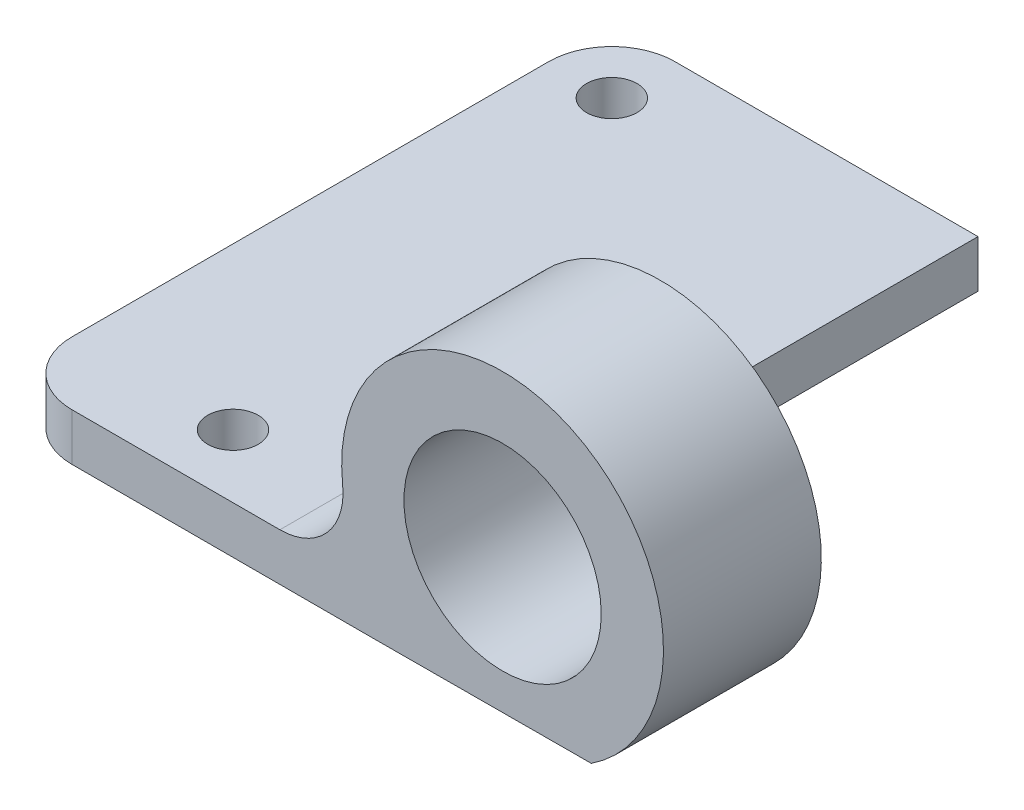
ISO-10303-21;
HEADER;
FILE_DESCRIPTION(('STEP AP214'),'2;1');
FILE_NAME('part.step','',(''),(''),'','','');
FILE_SCHEMA(('AUTOMOTIVE_DESIGN { 1 0 10303 214 1 1 1 1 }'));
ENDSEC;
DATA;
#1=APPLICATION_CONTEXT('core data for automotive mechanical design processes');
#2=APPLICATION_PROTOCOL_DEFINITION('international standard','automotive_design',2000,#1);
#3=PRODUCT_CONTEXT('',#1,'mechanical');
#4=PRODUCT('Part','Part','',(#3));
#5=PRODUCT_RELATED_PRODUCT_CATEGORY('part','',(#4));
#6=PRODUCT_DEFINITION_FORMATION('','',#4);
#7=PRODUCT_DEFINITION_CONTEXT('part definition',#1,'design');
#8=PRODUCT_DEFINITION('design','',#6,#7);
#9=PRODUCT_DEFINITION_SHAPE('','',#8);
#10=(LENGTH_UNIT() NAMED_UNIT(*) SI_UNIT(.MILLI.,.METRE.));
#11=(NAMED_UNIT(*) PLANE_ANGLE_UNIT() SI_UNIT($,.RADIAN.));
#12=(NAMED_UNIT(*) SI_UNIT($,.STERADIAN.) SOLID_ANGLE_UNIT());
#13=UNCERTAINTY_MEASURE_WITH_UNIT(LENGTH_MEASURE(1.E-05),#10,'distance_accuracy_value','');
#14=(GEOMETRIC_REPRESENTATION_CONTEXT(3) GLOBAL_UNCERTAINTY_ASSIGNED_CONTEXT((#13)) GLOBAL_UNIT_ASSIGNED_CONTEXT((#10,
#11,#12)) REPRESENTATION_CONTEXT('',''));
#15=CARTESIAN_POINT('',(0.,0.,0.));
#16=DIRECTION('',(0.,0.,1.));
#17=DIRECTION('',(1.,0.,0.));
#18=AXIS2_PLACEMENT_3D('',#15,#16,#17);
#19=CARTESIAN_POINT('',(19.20855083042,3.,-4.37947906748812));
#20=DIRECTION('',(-1.,0.,0.));
#21=DIRECTION('',(0.,0.,1.));
#22=AXIS2_PLACEMENT_3D('',#19,#20,#21);
#23=PLANE('',#22);
#24=DIRECTION('',(0.,1.,0.));
#25=VECTOR('',#24,1.);
#26=CARTESIAN_POINT('',(19.20855083042,3.,23.8205209325119));
#27=LINE('',#26,#25);
#28=CARTESIAN_POINT('',(19.20855083042,0.,23.8205209325119));
#29=VERTEX_POINT('',#28);
#30=CARTESIAN_POINT('',(19.20855083042,3.,23.8205209325119));
#31=VERTEX_POINT('',#30);
#32=EDGE_CURVE('E223',#29,#31,#27,.T.);
#33=ORIENTED_EDGE('',*,*,#32,.F.);
#34=DIRECTION('',(0.,0.,-1.));
#35=VECTOR('',#34,1.);
#36=CARTESIAN_POINT('',(19.20855083042,0.,-4.37947906748812));
#37=LINE('',#36,#35);
#38=CARTESIAN_POINT('',(19.20855083042,0.,-4.37947906748812));
#39=VERTEX_POINT('',#38);
#40=EDGE_CURVE('E188',#29,#39,#37,.T.);
#41=ORIENTED_EDGE('',*,*,#40,.T.);
#42=DIRECTION('',(0.,-1.,0.));
#43=VECTOR('',#42,1.);
#44=CARTESIAN_POINT('',(19.20855083042,3.,-4.37947906748812));
#45=LINE('',#44,#43);
#46=CARTESIAN_POINT('',(19.20855083042,3.,-4.37947906748812));
#47=VERTEX_POINT('',#46);
#48=EDGE_CURVE('E181',#47,#39,#45,.T.);
#49=ORIENTED_EDGE('',*,*,#48,.F.);
#50=DIRECTION('',(0.,0.,-1.));
#51=VECTOR('',#50,1.);
#52=CARTESIAN_POINT('',(19.20855083042,3.,-4.37947906748812));
#53=LINE('',#52,#51);
#54=EDGE_CURVE('E174',#31,#47,#53,.T.);
#55=ORIENTED_EDGE('',*,*,#54,.F.);
#56=EDGE_LOOP('',(#33,#41,#49,#55));
#57=FACE_BOUND('',#56,.T.);
#58=ADVANCED_FACE('F39',(#57),#23,.F.);
#59=CARTESIAN_POINT('',(0.,3.,0.));
#60=DIRECTION('',(0.,1.,0.));
#61=DIRECTION('',(0.,0.,1.));
#62=AXIS2_PLACEMENT_3D('',#59,#60,#61);
#63=PLANE('',#62);
#64=DIRECTION('',(1.,0.,0.));
#65=VECTOR('',#64,1.);
#66=CARTESIAN_POINT('',(-3.99144916957995,3.,33.8205209325119));
#67=LINE('',#66,#65);
#68=CARTESIAN_POINT('',(0.00855083042004476,3.,33.8205209325119));
#69=VERTEX_POINT('',#68);
#70=CARTESIAN_POINT('',(13.1798688788794,3.,33.8205209325119));
#71=VERTEX_POINT('',#70);
#72=EDGE_CURVE('E170',#69,#71,#67,.T.);
#73=ORIENTED_EDGE('',*,*,#72,.T.);
#74=DIRECTION('',(0.,0.,-1.));
#75=VECTOR('',#74,1.);
#76=CARTESIAN_POINT('',(13.1798688788794,3.,23.8205209325119));
#77=LINE('',#76,#75);
#78=CARTESIAN_POINT('',(13.1798688788794,3.,23.8205209325119));
#79=VERTEX_POINT('',#78);
#80=EDGE_CURVE('E229',#71,#79,#77,.T.);
#81=ORIENTED_EDGE('',*,*,#80,.T.);
#82=DIRECTION('',(1.,0.,0.));
#83=VECTOR('',#82,1.);
#84=CARTESIAN_POINT('',(0.,3.,23.8205209325119));
#85=LINE('',#84,#83);
#86=EDGE_CURVE('E54',#79,#31,#85,.T.);
#87=ORIENTED_EDGE('',*,*,#86,.T.);
#88=ORIENTED_EDGE('',*,*,#54,.T.);
#89=DIRECTION('',(-1.,0.,0.));
#90=VECTOR('',#89,1.);
#91=CARTESIAN_POINT('',(-3.99144916957996,3.,-4.37947906748812));
#92=LINE('',#91,#90);
#93=CARTESIAN_POINT('',(0.00855083042004216,3.,-4.37947906748812));
#94=VERTEX_POINT('',#93);
#95=EDGE_CURVE('E177',#47,#94,#92,.T.);
#96=ORIENTED_EDGE('',*,*,#95,.T.);
#97=CARTESIAN_POINT('',(0.00855083042004174,3.,-0.37947906748812));
#98=DIRECTION('',(0.,1.,0.));
#99=DIRECTION('',(0.,0.,1.));
#100=AXIS2_PLACEMENT_3D('',#97,#98,#99);
#101=CIRCLE('',#100,4.);
#102=CARTESIAN_POINT('',(-3.99144916957996,3.,-0.37947906748812));
#103=VERTEX_POINT('',#102);
#104=EDGE_CURVE('E214',#94,#103,#101,.T.);
#105=ORIENTED_EDGE('',*,*,#104,.T.);
#106=DIRECTION('',(0.,0.,1.));
#107=VECTOR('',#106,1.);
#108=CARTESIAN_POINT('',(-3.99144916957996,3.,-4.37947906748812));
#109=LINE('',#108,#107);
#110=CARTESIAN_POINT('',(-3.99144916957996,3.,29.8205209325119));
#111=VERTEX_POINT('',#110);
#112=EDGE_CURVE('E166',#103,#111,#109,.T.);
#113=ORIENTED_EDGE('',*,*,#112,.T.);
#114=CARTESIAN_POINT('',(0.00855083042004476,3.,29.8205209325119));
#115=DIRECTION('',(0.,1.,0.));
#116=DIRECTION('',(0.,0.,1.));
#117=AXIS2_PLACEMENT_3D('',#114,#115,#116);
#118=CIRCLE('',#117,4.);
#119=EDGE_CURVE('E217',#111,#69,#118,.T.);
#120=ORIENTED_EDGE('',*,*,#119,.T.);
#121=EDGE_LOOP('',(#73,#81,#87,#88,#96,#105,#113,#120));
#122=FACE_BOUND('',#121,.T.);
#123=CARTESIAN_POINT('',(0.00855083042004216,3.,-0.37947906748812));
#124=DIRECTION('',(0.,1.,0.));
#125=DIRECTION('',(0.,0.,1.));
#126=AXIS2_PLACEMENT_3D('',#123,#124,#125);
#127=CIRCLE('',#126,1.6);
#128=CARTESIAN_POINT('',(0.00855083042004216,3.,1.22052093251188));
#129=VERTEX_POINT('',#128);
#130=EDGE_CURVE('E158',#129,#129,#127,.T.);
#131=ORIENTED_EDGE('',*,*,#130,.F.);
#132=EDGE_LOOP('',(#131));
#133=FACE_BOUND('',#132,.T.);
#134=CARTESIAN_POINT('',(6.20855083042005,3.,29.8205209325119));
#135=DIRECTION('',(0.,1.,0.));
#136=DIRECTION('',(0.,0.,1.));
#137=AXIS2_PLACEMENT_3D('',#134,#135,#136);
#138=CIRCLE('',#137,1.6);
#139=CARTESIAN_POINT('',(6.20855083042005,3.,31.4205209325119));
#140=VERTEX_POINT('',#139);
#141=EDGE_CURVE('E150',#140,#140,#138,.T.);
#142=ORIENTED_EDGE('',*,*,#141,.F.);
#143=EDGE_LOOP('',(#142));
#144=FACE_BOUND('',#143,.T.);
#145=ADVANCED_FACE('F257',(#122,#133,#144),#63,.T.);
#146=CARTESIAN_POINT('',(0.,0.,0.));
#147=DIRECTION('',(0.,1.,0.));
#148=DIRECTION('',(0.,0.,1.));
#149=AXIS2_PLACEMENT_3D('',#146,#147,#148);
#150=PLANE('',#149);
#151=DIRECTION('',(1.,0.,0.));
#152=VECTOR('',#151,1.);
#153=CARTESIAN_POINT('',(-3.99144916957995,0.,33.8205209325119));
#154=LINE('',#153,#152);
#155=CARTESIAN_POINT('',(0.00855083042004476,0.,33.8205209325119));
#156=VERTEX_POINT('',#155);
#157=CARTESIAN_POINT('',(19.20855083042,0.,33.8205209325119));
#158=VERTEX_POINT('',#157);
#159=EDGE_CURVE('E185',#156,#158,#154,.T.);
#160=ORIENTED_EDGE('',*,*,#159,.F.);
#161=CARTESIAN_POINT('',(0.00855083042004476,0.,29.8205209325119));
#162=DIRECTION('',(0.,1.,0.));
#163=DIRECTION('',(0.,0.,1.));
#164=AXIS2_PLACEMENT_3D('',#161,#162,#163);
#165=CIRCLE('',#164,4.);
#166=CARTESIAN_POINT('',(-3.99144916957996,0.,29.8205209325119));
#167=VERTEX_POINT('',#166);
#168=EDGE_CURVE('E204',#156,#167,#165,.F.);
#169=ORIENTED_EDGE('',*,*,#168,.T.);
#170=DIRECTION('',(0.,0.,1.));
#171=VECTOR('',#170,1.);
#172=CARTESIAN_POINT('',(-3.99144916957996,0.,-4.37947906748812));
#173=LINE('',#172,#171);
#174=CARTESIAN_POINT('',(-3.99144916957996,0.,-0.37947906748812));
#175=VERTEX_POINT('',#174);
#176=EDGE_CURVE('E162',#175,#167,#173,.T.);
#177=ORIENTED_EDGE('',*,*,#176,.F.);
#178=CARTESIAN_POINT('',(0.00855083042004174,0.,-0.37947906748812));
#179=DIRECTION('',(0.,1.,0.));
#180=DIRECTION('',(0.,0.,1.));
#181=AXIS2_PLACEMENT_3D('',#178,#179,#180);
#182=CIRCLE('',#181,4.);
#183=CARTESIAN_POINT('',(0.00855083042004216,0.,-4.37947906748812));
#184=VERTEX_POINT('',#183);
#185=EDGE_CURVE('E201',#175,#184,#182,.F.);
#186=ORIENTED_EDGE('',*,*,#185,.T.);
#187=DIRECTION('',(-1.,0.,0.));
#188=VECTOR('',#187,1.);
#189=CARTESIAN_POINT('',(-3.99144916957996,0.,-4.37947906748812));
#190=LINE('',#189,#188);
#191=EDGE_CURVE('E171',#39,#184,#190,.T.);
#192=ORIENTED_EDGE('',*,*,#191,.F.);
#193=ORIENTED_EDGE('',*,*,#40,.F.);
#194=EDGE_CURVE('E131',#158,#29,#37,.T.);
#195=ORIENTED_EDGE('',*,*,#194,.F.);
#196=EDGE_LOOP('',(#160,#169,#177,#186,#192,#193,#195));
#197=FACE_BOUND('',#196,.T.);
#198=CARTESIAN_POINT('',(0.00855083042004216,0.,-0.37947906748812));
#199=DIRECTION('',(0.,1.,0.));
#200=DIRECTION('',(0.,0.,1.));
#201=AXIS2_PLACEMENT_3D('',#198,#199,#200);
#202=CIRCLE('',#201,1.6);
#203=CARTESIAN_POINT('',(0.00855083042004216,0.,1.22052093251188));
#204=VERTEX_POINT('',#203);
#205=EDGE_CURVE('E154',#204,#204,#202,.T.);
#206=ORIENTED_EDGE('',*,*,#205,.T.);
#207=EDGE_LOOP('',(#206));
#208=FACE_BOUND('',#207,.T.);
#209=CARTESIAN_POINT('',(6.20855083042005,0.,29.8205209325119));
#210=DIRECTION('',(0.,1.,0.));
#211=DIRECTION('',(0.,0.,1.));
#212=AXIS2_PLACEMENT_3D('',#209,#210,#211);
#213=CIRCLE('',#212,1.6);
#214=CARTESIAN_POINT('',(6.20855083042005,0.,31.4205209325119));
#215=VERTEX_POINT('',#214);
#216=EDGE_CURVE('E149',#215,#215,#213,.T.);
#217=ORIENTED_EDGE('',*,*,#216,.T.);
#218=EDGE_LOOP('',(#217));
#219=FACE_BOUND('',#218,.T.);
#220=ADVANCED_FACE('F244',(#197,#208,#219),#150,.F.);
#221=CARTESIAN_POINT('',(-3.99144916957996,3.,-4.37947906748812));
#222=DIRECTION('',(1.,0.,0.));
#223=DIRECTION('',(0.,0.,-1.));
#224=AXIS2_PLACEMENT_3D('',#221,#222,#223);
#225=PLANE('',#224);
#226=ORIENTED_EDGE('',*,*,#176,.T.);
#227=DIRECTION('',(0.,-1.,0.));
#228=VECTOR('',#227,1.);
#229=CARTESIAN_POINT('',(-3.99144916957996,3.,29.8205209325119));
#230=LINE('',#229,#228);
#231=EDGE_CURVE('E211',#167,#111,#230,.F.);
#232=ORIENTED_EDGE('',*,*,#231,.T.);
#233=ORIENTED_EDGE('',*,*,#112,.F.);
#234=DIRECTION('',(0.,-1.,0.));
#235=VECTOR('',#234,1.);
#236=CARTESIAN_POINT('',(-3.99144916957996,3.,-0.37947906748812));
#237=LINE('',#236,#235);
#238=EDGE_CURVE('E207',#103,#175,#237,.T.);
#239=ORIENTED_EDGE('',*,*,#238,.T.);
#240=EDGE_LOOP('',(#226,#232,#233,#239));
#241=FACE_BOUND('',#240,.T.);
#242=ADVANCED_FACE('F253',(#241),#225,.F.);
#243=CARTESIAN_POINT('',(-3.99144916957995,3.,33.8205209325119));
#244=DIRECTION('',(0.,0.,-1.));
#245=DIRECTION('',(-1.,0.,0.));
#246=AXIS2_PLACEMENT_3D('',#243,#244,#245);
#247=PLANE('',#246);
#248=CARTESIAN_POINT('',(27.28855083042,8.55,33.8205209325119));
#249=DIRECTION('',(0.,0.,1.));
#250=DIRECTION('',(1.,0.,0.));
#251=AXIS2_PLACEMENT_3D('',#248,#249,#250);
#252=CIRCLE('',#251,10.1935691920577);
#253=CARTESIAN_POINT('',(32.9110967520727,0.0473045313750961,33.8205209325119));
#254=VERTEX_POINT('',#253);
#255=CARTESIAN_POINT('',(17.1559461461634,7.43681754152925,33.8205209325119));
#256=VERTEX_POINT('',#255);
#257=EDGE_CURVE('E120',#254,#256,#252,.T.);
#258=ORIENTED_EDGE('',*,*,#257,.T.);
#259=CARTESIAN_POINT('',(13.1798688788794,7.,33.8205209325119));
#260=DIRECTION('',(0.,0.,-1.));
#261=DIRECTION('',(-1.,0.,0.));
#262=AXIS2_PLACEMENT_3D('',#259,#260,#261);
#263=CIRCLE('',#262,4.);
#264=EDGE_CURVE('E48',#256,#71,#263,.T.);
#265=ORIENTED_EDGE('',*,*,#264,.T.);
#266=ORIENTED_EDGE('',*,*,#72,.F.);
#267=DIRECTION('',(0.,-1.,0.));
#268=VECTOR('',#267,1.);
#269=CARTESIAN_POINT('',(0.00855083042004476,3.,33.8205209325119));
#270=LINE('',#269,#268);
#271=EDGE_CURVE('E197',#69,#156,#270,.T.);
#272=ORIENTED_EDGE('',*,*,#271,.T.);
#273=ORIENTED_EDGE('',*,*,#159,.T.);
#274=DIRECTION('',(0.999994041059089,0.00345222338685537,0.));
#275=VECTOR('',#274,1.);
#276=CARTESIAN_POINT('',(19.20855083042,0.,33.8205209325119));
#277=LINE('',#276,#275);
#278=EDGE_CURVE('E141',#158,#254,#277,.T.);
#279=ORIENTED_EDGE('',*,*,#278,.T.);
#280=EDGE_LOOP('',(#258,#265,#266,#272,#273,#279));
#281=FACE_BOUND('',#280,.T.);
#282=CARTESIAN_POINT('',(27.28855083042,8.55,33.8205209325119));
#283=DIRECTION('',(0.,0.,1.));
#284=DIRECTION('',(1.,0.,0.));
#285=AXIS2_PLACEMENT_3D('',#282,#283,#284);
#286=CIRCLE('',#285,6.25);
#287=CARTESIAN_POINT('',(33.53855083042,8.55,33.8205209325119));
#288=VERTEX_POINT('',#287);
#289=EDGE_CURVE('E406',#288,#288,#286,.T.);
#290=ORIENTED_EDGE('',*,*,#289,.F.);
#291=EDGE_LOOP('',(#290));
#292=FACE_BOUND('',#291,.T.);
#293=ADVANCED_FACE('F262',(#281,#292),#247,.F.);
#294=CARTESIAN_POINT('',(-3.99144916957996,3.,-4.37947906748812));
#295=DIRECTION('',(0.,0.,1.));
#296=DIRECTION('',(1.,0.,0.));
#297=AXIS2_PLACEMENT_3D('',#294,#295,#296);
#298=PLANE('',#297);
#299=ORIENTED_EDGE('',*,*,#191,.T.);
#300=DIRECTION('',(0.,-1.,0.));
#301=VECTOR('',#300,1.);
#302=CARTESIAN_POINT('',(0.00855083042004216,3.,-4.37947906748812));
#303=LINE('',#302,#301);
#304=EDGE_CURVE('E220',#184,#94,#303,.F.);
#305=ORIENTED_EDGE('',*,*,#304,.T.);
#306=ORIENTED_EDGE('',*,*,#95,.F.);
#307=ORIENTED_EDGE('',*,*,#48,.T.);
#308=EDGE_LOOP('',(#299,#305,#306,#307));
#309=FACE_BOUND('',#308,.T.);
#310=ADVANCED_FACE('F241',(#309),#298,.F.);
#311=CARTESIAN_POINT('',(0.00855083042004216,3.,-0.37947906748812));
#312=DIRECTION('',(0.,-1.,0.));
#313=DIRECTION('',(0.,0.,-1.));
#314=AXIS2_PLACEMENT_3D('',#311,#312,#313);
#315=CYLINDRICAL_SURFACE('',#314,1.6);
#316=ORIENTED_EDGE('',*,*,#130,.T.);
#317=EDGE_LOOP('',(#316));
#318=FACE_BOUND('',#317,.T.);
#319=ORIENTED_EDGE('',*,*,#205,.F.);
#320=EDGE_LOOP('',(#319));
#321=FACE_BOUND('',#320,.T.);
#322=ADVANCED_FACE('F301',(#318,#321),#315,.F.);
#323=CARTESIAN_POINT('',(6.20855083042005,3.,29.8205209325119));
#324=DIRECTION('',(0.,-1.,0.));
#325=DIRECTION('',(0.,0.,-1.));
#326=AXIS2_PLACEMENT_3D('',#323,#324,#325);
#327=CYLINDRICAL_SURFACE('',#326,1.6);
#328=ORIENTED_EDGE('',*,*,#141,.T.);
#329=EDGE_LOOP('',(#328));
#330=FACE_BOUND('',#329,.T.);
#331=ORIENTED_EDGE('',*,*,#216,.F.);
#332=EDGE_LOOP('',(#331));
#333=FACE_BOUND('',#332,.T.);
#334=ADVANCED_FACE('F287',(#330,#333),#327,.F.);
#335=CARTESIAN_POINT('',(0.00855083042004476,3.,29.8205209325119));
#336=DIRECTION('',(0.,-1.,0.));
#337=DIRECTION('',(0.,0.,-1.));
#338=AXIS2_PLACEMENT_3D('',#335,#336,#337);
#339=CYLINDRICAL_SURFACE('',#338,4.);
#340=ORIENTED_EDGE('',*,*,#119,.F.);
#341=ORIENTED_EDGE('',*,*,#231,.F.);
#342=ORIENTED_EDGE('',*,*,#168,.F.);
#343=ORIENTED_EDGE('',*,*,#271,.F.);
#344=EDGE_LOOP('',(#340,#341,#342,#343));
#345=FACE_BOUND('',#344,.T.);
#346=ADVANCED_FACE('F261',(#345),#339,.T.);
#347=CARTESIAN_POINT('',(0.00855083042004174,3.,-0.37947906748812));
#348=DIRECTION('',(0.,-1.,0.));
#349=DIRECTION('',(0.,0.,-1.));
#350=AXIS2_PLACEMENT_3D('',#347,#348,#349);
#351=CYLINDRICAL_SURFACE('',#350,4.);
#352=ORIENTED_EDGE('',*,*,#104,.F.);
#353=ORIENTED_EDGE('',*,*,#304,.F.);
#354=ORIENTED_EDGE('',*,*,#185,.F.);
#355=ORIENTED_EDGE('',*,*,#238,.F.);
#356=EDGE_LOOP('',(#352,#353,#354,#355));
#357=FACE_BOUND('',#356,.T.);
#358=ADVANCED_FACE('F250',(#357),#351,.T.);
#359=CARTESIAN_POINT('',(27.28855083042,8.55,23.8205209325119));
#360=DIRECTION('',(0.,0.,1.));
#361=DIRECTION('',(1.,0.,0.));
#362=AXIS2_PLACEMENT_3D('',#359,#360,#361);
#363=CYLINDRICAL_SURFACE('',#362,10.1935691920577);
#364=CARTESIAN_POINT('',(27.28855083042,8.55,23.8205209325119));
#365=DIRECTION('',(0.,0.,1.));
#366=DIRECTION('',(1.,0.,0.));
#367=AXIS2_PLACEMENT_3D('',#364,#365,#366);
#368=CIRCLE('',#367,10.1935691920577);
#369=CARTESIAN_POINT('',(32.9110967520727,0.0473045313750961,23.8205209325119));
#370=VERTEX_POINT('',#369);
#371=CARTESIAN_POINT('',(17.1559461461634,7.43681754152925,23.8205209325119));
#372=VERTEX_POINT('',#371);
#373=EDGE_CURVE('E118',#370,#372,#368,.T.);
#374=ORIENTED_EDGE('',*,*,#373,.T.);
#375=DIRECTION('',(0.,0.,1.));
#376=VECTOR('',#375,1.);
#377=CARTESIAN_POINT('',(17.1559461461634,7.43681754152925,23.8205209325119));
#378=LINE('',#377,#376);
#379=EDGE_CURVE('E226',#372,#256,#378,.T.);
#380=ORIENTED_EDGE('',*,*,#379,.T.);
#381=ORIENTED_EDGE('',*,*,#257,.F.);
#382=DIRECTION('',(0.,0.,1.));
#383=VECTOR('',#382,1.);
#384=CARTESIAN_POINT('',(32.9110967520727,0.0473045313750961,23.8205209325119));
#385=LINE('',#384,#383);
#386=EDGE_CURVE('E113',#370,#254,#385,.T.);
#387=ORIENTED_EDGE('',*,*,#386,.F.);
#388=EDGE_LOOP('',(#374,#380,#381,#387));
#389=FACE_BOUND('',#388,.T.);
#390=ADVANCED_FACE('F115',(#389),#363,.T.);
#391=CARTESIAN_POINT('',(19.20855083042,0.,23.8205209325119));
#392=DIRECTION('',(0.00345222338685537,-0.999994041059089,0.));
#393=DIRECTION('',(0.999994041059089,0.00345222338685537,0.));
#394=AXIS2_PLACEMENT_3D('',#391,#392,#393);
#395=PLANE('',#394);
#396=ORIENTED_EDGE('',*,*,#278,.F.);
#397=ORIENTED_EDGE('',*,*,#194,.T.);
#398=DIRECTION('',(0.999994041059089,0.00345222338685537,0.));
#399=VECTOR('',#398,1.);
#400=CARTESIAN_POINT('',(19.20855083042,0.,23.8205209325119));
#401=LINE('',#400,#399);
#402=EDGE_CURVE('E128',#29,#370,#401,.T.);
#403=ORIENTED_EDGE('',*,*,#402,.T.);
#404=ORIENTED_EDGE('',*,*,#386,.T.);
#405=EDGE_LOOP('',(#396,#397,#403,#404));
#406=FACE_BOUND('',#405,.T.);
#407=ADVANCED_FACE('F129',(#406),#395,.T.);
#408=CARTESIAN_POINT('',(27.28855083042,8.55,23.8205209325119));
#409=DIRECTION('',(0.,0.,1.));
#410=DIRECTION('',(1.,0.,0.));
#411=AXIS2_PLACEMENT_3D('',#408,#409,#410);
#412=PLANE('',#411);
#413=ORIENTED_EDGE('',*,*,#86,.F.);
#414=CARTESIAN_POINT('',(13.1798688788794,7.,23.8205209325119));
#415=DIRECTION('',(0.,0.,1.));
#416=DIRECTION('',(1.,0.,0.));
#417=AXIS2_PLACEMENT_3D('',#414,#415,#416);
#418=CIRCLE('',#417,4.);
#419=EDGE_CURVE('E11',#79,#372,#418,.T.);
#420=ORIENTED_EDGE('',*,*,#419,.T.);
#421=ORIENTED_EDGE('',*,*,#373,.F.);
#422=ORIENTED_EDGE('',*,*,#402,.F.);
#423=ORIENTED_EDGE('',*,*,#32,.T.);
#424=EDGE_LOOP('',(#413,#420,#421,#422,#423));
#425=FACE_BOUND('',#424,.T.);
#426=CARTESIAN_POINT('',(27.28855083042,8.55,23.8205209325119));
#427=DIRECTION('',(0.,0.,1.));
#428=DIRECTION('',(1.,0.,0.));
#429=AXIS2_PLACEMENT_3D('',#426,#427,#428);
#430=CIRCLE('',#429,6.25);
#431=CARTESIAN_POINT('',(33.53855083042,8.55,23.8205209325119));
#432=VERTEX_POINT('',#431);
#433=EDGE_CURVE('E144',#432,#432,#430,.T.);
#434=ORIENTED_EDGE('',*,*,#433,.T.);
#435=EDGE_LOOP('',(#434));
#436=FACE_BOUND('',#435,.T.);
#437=ADVANCED_FACE('F134',(#425,#436),#412,.F.);
#438=CARTESIAN_POINT('',(27.28855083042,8.55,23.8205209325119));
#439=DIRECTION('',(0.,0.,1.));
#440=DIRECTION('',(1.,0.,0.));
#441=AXIS2_PLACEMENT_3D('',#438,#439,#440);
#442=CYLINDRICAL_SURFACE('',#441,6.25);
#443=ORIENTED_EDGE('',*,*,#433,.F.);
#444=EDGE_LOOP('',(#443));
#445=FACE_BOUND('',#444,.T.);
#446=ORIENTED_EDGE('',*,*,#289,.T.);
#447=EDGE_LOOP('',(#446));
#448=FACE_BOUND('',#447,.T.);
#449=ADVANCED_FACE('F267',(#445,#448),#442,.F.);
#450=CARTESIAN_POINT('',(13.1798688788794,7.,23.8205209325119));
#451=DIRECTION('',(0.,0.,1.));
#452=DIRECTION('',(1.,0.,0.));
#453=AXIS2_PLACEMENT_3D('',#450,#451,#452);
#454=CYLINDRICAL_SURFACE('',#453,4.);
#455=ORIENTED_EDGE('',*,*,#419,.F.);
#456=ORIENTED_EDGE('',*,*,#80,.F.);
#457=ORIENTED_EDGE('',*,*,#264,.F.);
#458=ORIENTED_EDGE('',*,*,#379,.F.);
#459=EDGE_LOOP('',(#455,#456,#457,#458));
#460=FACE_BOUND('',#459,.T.);
#461=ADVANCED_FACE('F41',(#460),#454,.F.);
#462=CLOSED_SHELL('',(#58,#145,#220,#242,#293,#310,#322,#334,#346,#358,#390,#407,#437,#449,#461));
#463=MANIFOLD_SOLID_BREP('B2',#462);
#464=ADVANCED_BREP_SHAPE_REPRESENTATION('',(#18,#463),#14);
#465=SHAPE_DEFINITION_REPRESENTATION(#9,#464);
ENDSEC;
END-ISO-10303-21;
